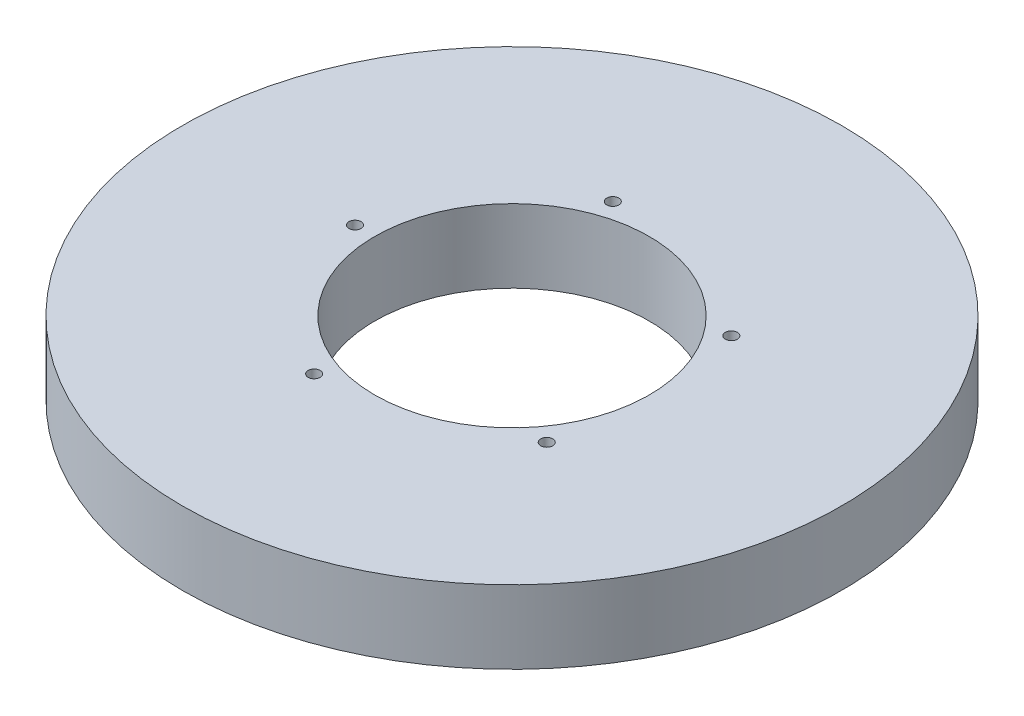
ISO-10303-21;
HEADER;
FILE_DESCRIPTION(('STEP AP214'),'2;1');
FILE_NAME('part.step','',(''),(''),'','','');
FILE_SCHEMA(('AUTOMOTIVE_DESIGN { 1 0 10303 214 1 1 1 1 }'));
ENDSEC;
DATA;
#1=APPLICATION_CONTEXT('core data for automotive mechanical design processes');
#2=APPLICATION_PROTOCOL_DEFINITION('international standard','automotive_design',2000,#1);
#3=PRODUCT_CONTEXT('',#1,'mechanical');
#4=PRODUCT('Part','Part','',(#3));
#5=PRODUCT_RELATED_PRODUCT_CATEGORY('part','',(#4));
#6=PRODUCT_DEFINITION_FORMATION('','',#4);
#7=PRODUCT_DEFINITION_CONTEXT('part definition',#1,'design');
#8=PRODUCT_DEFINITION('design','',#6,#7);
#9=PRODUCT_DEFINITION_SHAPE('','',#8);
#10=(LENGTH_UNIT() NAMED_UNIT(*) SI_UNIT(.MILLI.,.METRE.));
#11=(NAMED_UNIT(*) PLANE_ANGLE_UNIT() SI_UNIT($,.RADIAN.));
#12=(NAMED_UNIT(*) SI_UNIT($,.STERADIAN.) SOLID_ANGLE_UNIT());
#13=UNCERTAINTY_MEASURE_WITH_UNIT(LENGTH_MEASURE(1.E-05),#10,'distance_accuracy_value','');
#14=(GEOMETRIC_REPRESENTATION_CONTEXT(3) GLOBAL_UNCERTAINTY_ASSIGNED_CONTEXT((#13)) GLOBAL_UNIT_ASSIGNED_CONTEXT((#10,
#11,#12)) REPRESENTATION_CONTEXT('',''));
#15=CARTESIAN_POINT('',(0.,0.,0.));
#16=DIRECTION('',(0.,0.,1.));
#17=DIRECTION('',(1.,0.,0.));
#18=AXIS2_PLACEMENT_3D('',#15,#16,#17);
#19=CARTESIAN_POINT('',(0.,20.,0.));
#20=DIRECTION('',(0.,-1.,0.));
#21=DIRECTION('',(0.,0.,-1.));
#22=AXIS2_PLACEMENT_3D('',#19,#20,#21);
#23=CYLINDRICAL_SURFACE('',#22,90.);
#24=CARTESIAN_POINT('',(0.,20.,0.));
#25=DIRECTION('',(0.,1.,0.));
#26=DIRECTION('',(0.,0.,1.));
#27=AXIS2_PLACEMENT_3D('',#24,#25,#26);
#28=CIRCLE('',#27,90.);
#29=CARTESIAN_POINT('',(0.,20.,90.));
#30=VERTEX_POINT('',#29);
#31=EDGE_CURVE('E10',#30,#30,#28,.T.);
#32=ORIENTED_EDGE('',*,*,#31,.F.);
#33=EDGE_LOOP('',(#32));
#34=FACE_BOUND('',#33,.T.);
#35=CARTESIAN_POINT('',(0.,0.,0.));
#36=DIRECTION('',(0.,1.,0.));
#37=DIRECTION('',(0.,0.,1.));
#38=AXIS2_PLACEMENT_3D('',#35,#36,#37);
#39=CIRCLE('',#38,90.);
#40=CARTESIAN_POINT('',(0.,0.,90.));
#41=VERTEX_POINT('',#40);
#42=EDGE_CURVE('E37',#41,#41,#39,.T.);
#43=ORIENTED_EDGE('',*,*,#42,.T.);
#44=EDGE_LOOP('',(#43));
#45=FACE_BOUND('',#44,.T.);
#46=ADVANCED_FACE('F40',(#34,#45),#23,.T.);
#47=CARTESIAN_POINT('',(0.,20.,0.));
#48=DIRECTION('',(0.,1.,0.));
#49=DIRECTION('',(0.,0.,1.));
#50=AXIS2_PLACEMENT_3D('',#47,#48,#49);
#51=PLANE('',#50);
#52=CARTESIAN_POINT('',(-13.249070567616,20.,40.7764463688254));
#53=DIRECTION('',(0.,1.,0.));
#54=DIRECTION('',(0.951056516295155,0.,0.309016994374945));
#55=AXIS2_PLACEMENT_3D('',#52,#53,#54);
#56=CIRCLE('',#55,1.64824003144651);
#57=CARTESIAN_POINT('',(-11.6815011452903,20.,41.2857805493514));
#58=VERTEX_POINT('',#57);
#59=EDGE_CURVE('E78',#58,#58,#56,.T.);
#60=ORIENTED_EDGE('',*,*,#59,.F.);
#61=EDGE_LOOP('',(#60));
#62=FACE_BOUND('',#61,.T.);
#63=CARTESIAN_POINT('',(34.686517065365,20.,25.2012297963711));
#64=DIRECTION('',(0.,1.,0.));
#65=DIRECTION('',(0.587785252292469,0.,-0.809016994374951));
#66=AXIS2_PLACEMENT_3D('',#63,#64,#65);
#67=CIRCLE('',#66,1.64824003144651);
#68=CARTESIAN_POINT('',(35.6553282480873,20.,23.8677756001217));
#69=VERTEX_POINT('',#68);
#70=EDGE_CURVE('E71',#69,#69,#67,.T.);
#71=ORIENTED_EDGE('',*,*,#70,.F.);
#72=EDGE_LOOP('',(#71));
#73=FACE_BOUND('',#72,.T.);
#74=CARTESIAN_POINT('',(34.6865170653646,20.,-25.2012297963716));
#75=DIRECTION('',(0.,1.,0.));
#76=DIRECTION('',(-0.58778525229248,0.,-0.809016994374942));
#77=AXIS2_PLACEMENT_3D('',#74,#75,#76);
#78=CIRCLE('',#77,1.64824003144651);
#79=CARTESIAN_POINT('',(33.7177058826423,20.,-26.5346839926209));
#80=VERTEX_POINT('',#79);
#81=EDGE_CURVE('E70',#80,#80,#78,.T.);
#82=ORIENTED_EDGE('',*,*,#81,.F.);
#83=EDGE_LOOP('',(#82));
#84=FACE_BOUND('',#83,.T.);
#85=CARTESIAN_POINT('',(-13.2490705676166,20.,-40.7764463688252));
#86=DIRECTION('',(0.,1.,0.));
#87=DIRECTION('',(-0.95105651629515,0.,0.309016994374958));
#88=AXIS2_PLACEMENT_3D('',#85,#86,#87);
#89=CIRCLE('',#88,1.64824003144651);
#90=CARTESIAN_POINT('',(-14.8166399899423,20.,-40.2671121882991));
#91=VERTEX_POINT('',#90);
#92=EDGE_CURVE('E61',#91,#91,#89,.T.);
#93=ORIENTED_EDGE('',*,*,#92,.F.);
#94=EDGE_LOOP('',(#93));
#95=FACE_BOUND('',#94,.T.);
#96=CARTESIAN_POINT('',(-42.8748929954975,20.,0.));
#97=DIRECTION('',(0.,1.,0.));
#98=DIRECTION('',(0.,0.,1.));
#99=AXIS2_PLACEMENT_3D('',#96,#97,#98);
#100=CIRCLE('',#99,1.64824003144651);
#101=CARTESIAN_POINT('',(-42.8748929954975,20.,1.64824003144651));
#102=VERTEX_POINT('',#101);
#103=EDGE_CURVE('E54',#102,#102,#100,.T.);
#104=ORIENTED_EDGE('',*,*,#103,.F.);
#105=EDGE_LOOP('',(#104));
#106=FACE_BOUND('',#105,.T.);
#107=CARTESIAN_POINT('',(0.,20.,0.));
#108=DIRECTION('',(0.,1.,0.));
#109=DIRECTION('',(0.,0.,1.));
#110=AXIS2_PLACEMENT_3D('',#107,#108,#109);
#111=CIRCLE('',#110,37.5);
#112=CARTESIAN_POINT('',(0.,20.,37.5));
#113=VERTEX_POINT('',#112);
#114=EDGE_CURVE('E50',#113,#113,#111,.T.);
#115=ORIENTED_EDGE('',*,*,#114,.F.);
#116=EDGE_LOOP('',(#115));
#117=FACE_BOUND('',#116,.T.);
#118=ORIENTED_EDGE('',*,*,#31,.T.);
#119=EDGE_LOOP('',(#118));
#120=FACE_BOUND('',#119,.T.);
#121=ADVANCED_FACE('F94',(#62,#73,#84,#95,#106,#117,#120),#51,.T.);
#122=CARTESIAN_POINT('',(0.,0.,0.));
#123=DIRECTION('',(0.,1.,0.));
#124=DIRECTION('',(0.,0.,1.));
#125=AXIS2_PLACEMENT_3D('',#122,#123,#124);
#126=PLANE('',#125);
#127=CARTESIAN_POINT('',(0.,0.,0.));
#128=DIRECTION('',(0.,1.,0.));
#129=DIRECTION('',(0.,0.,1.));
#130=AXIS2_PLACEMENT_3D('',#127,#128,#129);
#131=CIRCLE('',#130,37.5);
#132=CARTESIAN_POINT('',(0.,0.,37.5));
#133=VERTEX_POINT('',#132);
#134=EDGE_CURVE('E47',#133,#133,#131,.T.);
#135=ORIENTED_EDGE('',*,*,#134,.T.);
#136=EDGE_LOOP('',(#135));
#137=FACE_BOUND('',#136,.T.);
#138=ORIENTED_EDGE('',*,*,#42,.F.);
#139=EDGE_LOOP('',(#138));
#140=FACE_BOUND('',#139,.T.);
#141=ADVANCED_FACE('F100',(#137,#140),#126,.F.);
#142=CARTESIAN_POINT('',(0.,20.,0.));
#143=DIRECTION('',(0.,-1.,0.));
#144=DIRECTION('',(0.,0.,-1.));
#145=AXIS2_PLACEMENT_3D('',#142,#143,#144);
#146=CYLINDRICAL_SURFACE('',#145,37.5);
#147=ORIENTED_EDGE('',*,*,#114,.T.);
#148=EDGE_LOOP('',(#147));
#149=FACE_BOUND('',#148,.T.);
#150=ORIENTED_EDGE('',*,*,#134,.F.);
#151=EDGE_LOOP('',(#150));
#152=FACE_BOUND('',#151,.T.);
#153=ADVANCED_FACE('F108',(#149,#152),#146,.F.);
#154=CARTESIAN_POINT('',(-42.8748929954975,0.589186532602381,0.));
#155=DIRECTION('',(0.,1.,0.));
#156=DIRECTION('',(0.,0.,1.));
#157=AXIS2_PLACEMENT_3D('',#154,#155,#156);
#158=CYLINDRICAL_SURFACE('',#157,1.64824003144651);
#159=CARTESIAN_POINT('',(-42.8748929954975,0.589186532602381,0.));
#160=DIRECTION('',(0.,1.,0.));
#161=DIRECTION('',(0.,0.,1.));
#162=AXIS2_PLACEMENT_3D('',#159,#160,#161);
#163=CIRCLE('',#162,1.64824003144651);
#164=CARTESIAN_POINT('',(-42.8748929954975,0.589186532602381,1.64824003144651));
#165=VERTEX_POINT('',#164);
#166=EDGE_CURVE('E55',#165,#165,#163,.T.);
#167=ORIENTED_EDGE('',*,*,#166,.F.);
#168=EDGE_LOOP('',(#167));
#169=FACE_BOUND('',#168,.T.);
#170=ORIENTED_EDGE('',*,*,#103,.T.);
#171=EDGE_LOOP('',(#170));
#172=FACE_BOUND('',#171,.T.);
#173=ADVANCED_FACE('F115',(#169,#172),#158,.F.);
#174=CARTESIAN_POINT('',(-42.8748929954975,0.589186532602381,0.));
#175=DIRECTION('',(0.,1.,0.));
#176=DIRECTION('',(0.,0.,1.));
#177=AXIS2_PLACEMENT_3D('',#174,#175,#176);
#178=PLANE('',#177);
#179=ORIENTED_EDGE('',*,*,#166,.T.);
#180=EDGE_LOOP('',(#179));
#181=FACE_BOUND('',#180,.T.);
#182=ADVANCED_FACE('F142',(#181),#178,.T.);
#183=CARTESIAN_POINT('',(-13.2490705676166,0.589186532602381,-40.7764463688252));
#184=DIRECTION('',(0.,1.,0.));
#185=DIRECTION('',(0.,0.,1.));
#186=AXIS2_PLACEMENT_3D('',#183,#184,#185);
#187=CYLINDRICAL_SURFACE('',#186,1.64824003144651);
#188=CARTESIAN_POINT('',(-13.2490705676166,0.589186532602381,-40.7764463688252));
#189=DIRECTION('',(0.,1.,0.));
#190=DIRECTION('',(-0.95105651629515,0.,0.309016994374958));
#191=AXIS2_PLACEMENT_3D('',#188,#189,#190);
#192=CIRCLE('',#191,1.64824003144651);
#193=CARTESIAN_POINT('',(-14.8166399899423,0.589186532602381,-40.2671121882991));
#194=VERTEX_POINT('',#193);
#195=EDGE_CURVE('E63',#194,#194,#192,.T.);
#196=ORIENTED_EDGE('',*,*,#195,.F.);
#197=EDGE_LOOP('',(#196));
#198=FACE_BOUND('',#197,.T.);
#199=ORIENTED_EDGE('',*,*,#92,.T.);
#200=EDGE_LOOP('',(#199));
#201=FACE_BOUND('',#200,.T.);
#202=ADVANCED_FACE('F147',(#198,#201),#187,.F.);
#203=CARTESIAN_POINT('',(-13.2490705676166,0.589186532602381,-40.7764463688252));
#204=DIRECTION('',(0.,1.,0.));
#205=DIRECTION('',(-0.95105651629515,0.,0.309016994374958));
#206=AXIS2_PLACEMENT_3D('',#203,#204,#205);
#207=PLANE('',#206);
#208=ORIENTED_EDGE('',*,*,#195,.T.);
#209=EDGE_LOOP('',(#208));
#210=FACE_BOUND('',#209,.T.);
#211=ADVANCED_FACE('F163',(#210),#207,.T.);
#212=CARTESIAN_POINT('',(34.6865170653646,0.589186532602381,-25.2012297963716));
#213=DIRECTION('',(0.,1.,0.));
#214=DIRECTION('',(0.,0.,1.));
#215=AXIS2_PLACEMENT_3D('',#212,#213,#214);
#216=CYLINDRICAL_SURFACE('',#215,1.64824003144651);
#217=CARTESIAN_POINT('',(34.6865170653646,0.589186532602381,-25.2012297963716));
#218=DIRECTION('',(0.,1.,0.));
#219=DIRECTION('',(-0.58778525229248,0.,-0.809016994374942));
#220=AXIS2_PLACEMENT_3D('',#217,#218,#219);
#221=CIRCLE('',#220,1.64824003144651);
#222=CARTESIAN_POINT('',(33.7177058826423,0.589186532602381,-26.5346839926209));
#223=VERTEX_POINT('',#222);
#224=EDGE_CURVE('E69',#223,#223,#221,.T.);
#225=ORIENTED_EDGE('',*,*,#224,.F.);
#226=EDGE_LOOP('',(#225));
#227=FACE_BOUND('',#226,.T.);
#228=ORIENTED_EDGE('',*,*,#81,.T.);
#229=EDGE_LOOP('',(#228));
#230=FACE_BOUND('',#229,.T.);
#231=ADVANCED_FACE('F172',(#227,#230),#216,.F.);
#232=CARTESIAN_POINT('',(34.6865170653646,0.589186532602381,-25.2012297963716));
#233=DIRECTION('',(0.,1.,0.));
#234=DIRECTION('',(-0.58778525229248,0.,-0.809016994374942));
#235=AXIS2_PLACEMENT_3D('',#232,#233,#234);
#236=PLANE('',#235);
#237=ORIENTED_EDGE('',*,*,#224,.T.);
#238=EDGE_LOOP('',(#237));
#239=FACE_BOUND('',#238,.T.);
#240=ADVANCED_FACE('F185',(#239),#236,.T.);
#241=CARTESIAN_POINT('',(34.686517065365,0.589186532602381,25.2012297963711));
#242=DIRECTION('',(0.,1.,0.));
#243=DIRECTION('',(0.,0.,1.));
#244=AXIS2_PLACEMENT_3D('',#241,#242,#243);
#245=CYLINDRICAL_SURFACE('',#244,1.64824003144651);
#246=CARTESIAN_POINT('',(34.686517065365,0.589186532602381,25.2012297963711));
#247=DIRECTION('',(0.,1.,0.));
#248=DIRECTION('',(0.587785252292469,0.,-0.809016994374951));
#249=AXIS2_PLACEMENT_3D('',#246,#247,#248);
#250=CIRCLE('',#249,1.64824003144651);
#251=CARTESIAN_POINT('',(35.6553282480873,0.589186532602381,23.8677756001217));
#252=VERTEX_POINT('',#251);
#253=EDGE_CURVE('E76',#252,#252,#250,.T.);
#254=ORIENTED_EDGE('',*,*,#253,.F.);
#255=EDGE_LOOP('',(#254));
#256=FACE_BOUND('',#255,.T.);
#257=ORIENTED_EDGE('',*,*,#70,.T.);
#258=EDGE_LOOP('',(#257));
#259=FACE_BOUND('',#258,.T.);
#260=ADVANCED_FACE('F191',(#256,#259),#245,.F.);
#261=CARTESIAN_POINT('',(34.686517065365,0.589186532602381,25.2012297963711));
#262=DIRECTION('',(0.,1.,0.));
#263=DIRECTION('',(0.587785252292469,0.,-0.809016994374951));
#264=AXIS2_PLACEMENT_3D('',#261,#262,#263);
#265=PLANE('',#264);
#266=ORIENTED_EDGE('',*,*,#253,.T.);
#267=EDGE_LOOP('',(#266));
#268=FACE_BOUND('',#267,.T.);
#269=ADVANCED_FACE('F89',(#268),#265,.T.);
#270=CARTESIAN_POINT('',(-13.249070567616,0.589186532602381,40.7764463688254));
#271=DIRECTION('',(0.,1.,0.));
#272=DIRECTION('',(0.,0.,1.));
#273=AXIS2_PLACEMENT_3D('',#270,#271,#272);
#274=CYLINDRICAL_SURFACE('',#273,1.64824003144651);
#275=CARTESIAN_POINT('',(-13.249070567616,0.589186532602381,40.7764463688254));
#276=DIRECTION('',(0.,1.,0.));
#277=DIRECTION('',(0.951056516295155,0.,0.309016994374945));
#278=AXIS2_PLACEMENT_3D('',#275,#276,#277);
#279=CIRCLE('',#278,1.64824003144651);
#280=CARTESIAN_POINT('',(-11.6815011452903,0.589186532602381,41.2857805493514));
#281=VERTEX_POINT('',#280);
#282=EDGE_CURVE('E59',#281,#281,#279,.T.);
#283=ORIENTED_EDGE('',*,*,#282,.F.);
#284=EDGE_LOOP('',(#283));
#285=FACE_BOUND('',#284,.T.);
#286=ORIENTED_EDGE('',*,*,#59,.T.);
#287=EDGE_LOOP('',(#286));
#288=FACE_BOUND('',#287,.T.);
#289=ADVANCED_FACE('F87',(#285,#288),#274,.F.);
#290=CARTESIAN_POINT('',(-13.249070567616,0.589186532602381,40.7764463688254));
#291=DIRECTION('',(0.,1.,0.));
#292=DIRECTION('',(0.951056516295155,0.,0.309016994374945));
#293=AXIS2_PLACEMENT_3D('',#290,#291,#292);
#294=PLANE('',#293);
#295=ORIENTED_EDGE('',*,*,#282,.T.);
#296=EDGE_LOOP('',(#295));
#297=FACE_BOUND('',#296,.T.);
#298=ADVANCED_FACE('F84',(#297),#294,.T.);
#299=CLOSED_SHELL('',(#46,#121,#141,#153,#173,#182,#202,#211,#231,#240,#260,#269,#289,#298));
#300=MANIFOLD_SOLID_BREP('B2',#299);
#301=ADVANCED_BREP_SHAPE_REPRESENTATION('',(#18,#300),#14);
#302=SHAPE_DEFINITION_REPRESENTATION(#9,#301);
ENDSEC;
END-ISO-10303-21;
